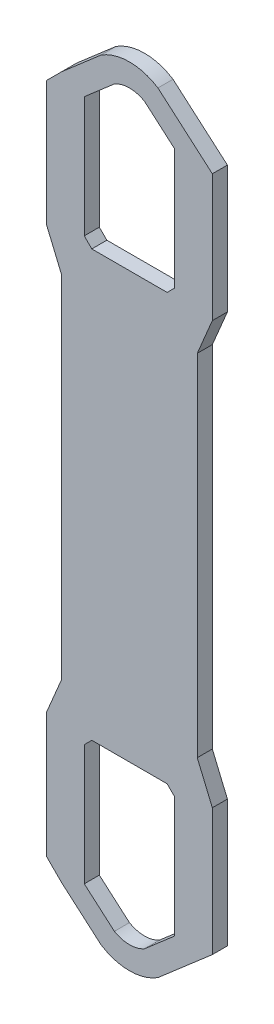
ISO-10303-21;
HEADER;
FILE_DESCRIPTION(('STEP AP214'),'2;1');
FILE_NAME('part.step','',(''),(''),'','','');
FILE_SCHEMA(('AUTOMOTIVE_DESIGN { 1 0 10303 214 1 1 1 1 }'));
ENDSEC;
DATA;
#1=APPLICATION_CONTEXT('core data for automotive mechanical design processes');
#2=APPLICATION_PROTOCOL_DEFINITION('international standard','automotive_design',2000,#1);
#3=PRODUCT_CONTEXT('',#1,'mechanical');
#4=PRODUCT('Part','Part','',(#3));
#5=PRODUCT_RELATED_PRODUCT_CATEGORY('part','',(#4));
#6=PRODUCT_DEFINITION_FORMATION('','',#4);
#7=PRODUCT_DEFINITION_CONTEXT('part definition',#1,'design');
#8=PRODUCT_DEFINITION('design','',#6,#7);
#9=PRODUCT_DEFINITION_SHAPE('','',#8);
#10=(LENGTH_UNIT() NAMED_UNIT(*) SI_UNIT(.MILLI.,.METRE.));
#11=(NAMED_UNIT(*) PLANE_ANGLE_UNIT() SI_UNIT($,.RADIAN.));
#12=(NAMED_UNIT(*) SI_UNIT($,.STERADIAN.) SOLID_ANGLE_UNIT());
#13=UNCERTAINTY_MEASURE_WITH_UNIT(LENGTH_MEASURE(1.E-05),#10,'distance_accuracy_value','');
#14=(GEOMETRIC_REPRESENTATION_CONTEXT(3) GLOBAL_UNCERTAINTY_ASSIGNED_CONTEXT((#13)) GLOBAL_UNIT_ASSIGNED_CONTEXT((#10,
#11,#12)) REPRESENTATION_CONTEXT('',''));
#15=CARTESIAN_POINT('',(0.,0.,0.));
#16=DIRECTION('',(0.,0.,1.));
#17=DIRECTION('',(1.,0.,0.));
#18=AXIS2_PLACEMENT_3D('',#15,#16,#17);
#19=CARTESIAN_POINT('',(0.,217.552949397752,5.));
#20=DIRECTION('',(0.,0.,-1.));
#21=DIRECTION('',(-1.,0.,0.));
#22=AXIS2_PLACEMENT_3D('',#19,#20,#21);
#23=CYLINDRICAL_SURFACE('',#22,9.99999999999999);
#24=CARTESIAN_POINT('',(0.,217.552949397752,0.));
#25=DIRECTION('',(0.,0.,1.));
#26=DIRECTION('',(1.,0.,0.));
#27=AXIS2_PLACEMENT_3D('',#24,#25,#26);
#28=CIRCLE('',#27,9.99999999999999);
#29=CARTESIAN_POINT('',(5.00000000000002,226.213203435596,0.));
#30=VERTEX_POINT('',#29);
#31=CARTESIAN_POINT('',(-5.,226.213203435596,0.));
#32=VERTEX_POINT('',#31);
#33=EDGE_CURVE('E364',#30,#32,#28,.T.);
#34=ORIENTED_EDGE('',*,*,#33,.F.);
#35=DIRECTION('',(0.,0.,-1.));
#36=VECTOR('',#35,1.);
#37=CARTESIAN_POINT('',(5.00000000000002,226.213203435596,5.));
#38=LINE('',#37,#36);
#39=CARTESIAN_POINT('',(5.00000000000002,226.213203435596,5.));
#40=VERTEX_POINT('',#39);
#41=EDGE_CURVE('E11',#40,#30,#38,.T.);
#42=ORIENTED_EDGE('',*,*,#41,.F.);
#43=CARTESIAN_POINT('',(0.,217.552949397752,5.));
#44=DIRECTION('',(0.,0.,1.));
#45=DIRECTION('',(1.,0.,0.));
#46=AXIS2_PLACEMENT_3D('',#43,#44,#45);
#47=CIRCLE('',#46,9.99999999999999);
#48=CARTESIAN_POINT('',(-5.,226.213203435596,5.));
#49=VERTEX_POINT('',#48);
#50=EDGE_CURVE('E537',#40,#49,#47,.T.);
#51=ORIENTED_EDGE('',*,*,#50,.T.);
#52=DIRECTION('',(0.,0.,-1.));
#53=VECTOR('',#52,1.);
#54=CARTESIAN_POINT('',(-5.,226.213203435596,5.));
#55=LINE('',#54,#53);
#56=EDGE_CURVE('E55',#49,#32,#55,.T.);
#57=ORIENTED_EDGE('',*,*,#56,.T.);
#58=EDGE_LOOP('',(#34,#42,#51,#57));
#59=FACE_BOUND('',#58,.T.);
#60=ADVANCED_FACE('F36',(#59),#23,.F.);
#61=CARTESIAN_POINT('',(114.089360483819,131.739045974011,5.));
#62=DIRECTION('',(-0.654653670707977,-0.755928946018455,0.));
#63=DIRECTION('',(0.755928946018455,-0.654653670707977,0.));
#64=AXIS2_PLACEMENT_3D('',#61,#62,#63);
#65=PLANE('',#64);
#66=DIRECTION('',(-0.755928946018455,0.654653670707977,0.));
#67=VECTOR('',#66,1.);
#68=CARTESIAN_POINT('',(114.089360483819,131.739045974011,0.));
#69=LINE('',#68,#67);
#70=CARTESIAN_POINT('',(15.,217.552949397752,0.));
#71=VERTEX_POINT('',#70);
#72=EDGE_CURVE('E366',#71,#30,#69,.T.);
#73=ORIENTED_EDGE('',*,*,#72,.F.);
#74=DIRECTION('',(0.,0.,-1.));
#75=VECTOR('',#74,1.);
#76=CARTESIAN_POINT('',(15.,217.552949397752,5.));
#77=LINE('',#76,#75);
#78=CARTESIAN_POINT('',(15.,217.552949397752,5.));
#79=VERTEX_POINT('',#78);
#80=EDGE_CURVE('E46',#79,#71,#77,.T.);
#81=ORIENTED_EDGE('',*,*,#80,.F.);
#82=DIRECTION('',(-0.755928946018455,0.654653670707977,0.));
#83=VECTOR('',#82,1.);
#84=CARTESIAN_POINT('',(114.089360483819,131.739045974011,5.));
#85=LINE('',#84,#83);
#86=EDGE_CURVE('E539',#79,#40,#85,.T.);
#87=ORIENTED_EDGE('',*,*,#86,.T.);
#88=ORIENTED_EDGE('',*,*,#41,.T.);
#89=EDGE_LOOP('',(#73,#81,#87,#88));
#90=FACE_BOUND('',#89,.T.);
#91=ADVANCED_FACE('F570',(#90),#65,.T.);
#92=CARTESIAN_POINT('',(15.,0.,5.));
#93=DIRECTION('',(1.,0.,0.));
#94=DIRECTION('',(0.,1.,0.));
#95=AXIS2_PLACEMENT_3D('',#92,#93,#94);
#96=PLANE('',#95);
#97=DIRECTION('',(0.,-1.,0.));
#98=VECTOR('',#97,1.);
#99=CARTESIAN_POINT('',(15.,0.,0.));
#100=LINE('',#99,#98);
#101=CARTESIAN_POINT('',(15.,177.552949397752,0.));
#102=VERTEX_POINT('',#101);
#103=EDGE_CURVE('E369',#71,#102,#100,.T.);
#104=ORIENTED_EDGE('',*,*,#103,.T.);
#105=DIRECTION('',(0.,0.,-1.));
#106=VECTOR('',#105,1.);
#107=CARTESIAN_POINT('',(15.,177.552949397752,5.));
#108=LINE('',#107,#106);
#109=CARTESIAN_POINT('',(15.,177.552949397752,5.));
#110=VERTEX_POINT('',#109);
#111=EDGE_CURVE('E392',#110,#102,#108,.T.);
#112=ORIENTED_EDGE('',*,*,#111,.F.);
#113=DIRECTION('',(0.,-1.,0.));
#114=VECTOR('',#113,1.);
#115=CARTESIAN_POINT('',(15.,0.,5.));
#116=LINE('',#115,#114);
#117=EDGE_CURVE('E542',#79,#110,#116,.T.);
#118=ORIENTED_EDGE('',*,*,#117,.F.);
#119=ORIENTED_EDGE('',*,*,#80,.T.);
#120=EDGE_LOOP('',(#104,#112,#118,#119));
#121=FACE_BOUND('',#120,.T.);
#122=ADVANCED_FACE('F575',(#121),#96,.F.);
#123=CARTESIAN_POINT('',(-81.2764746988762,81.2764746988778,5.));
#124=DIRECTION('',(0.70710678118654,-0.707106781186555,0.));
#125=DIRECTION('',(0.707106781186555,0.70710678118654,0.));
#126=AXIS2_PLACEMENT_3D('',#123,#124,#125);
#127=PLANE('',#126);
#128=DIRECTION('',(-0.707106781186555,-0.70710678118654,0.));
#129=VECTOR('',#128,1.);
#130=CARTESIAN_POINT('',(-81.2764746988762,81.2764746988778,0.));
#131=LINE('',#130,#129);
#132=CARTESIAN_POINT('',(12.5,175.052949397752,0.));
#133=VERTEX_POINT('',#132);
#134=EDGE_CURVE('E372',#102,#133,#131,.T.);
#135=ORIENTED_EDGE('',*,*,#134,.T.);
#136=DIRECTION('',(0.,0.,-1.));
#137=VECTOR('',#136,1.);
#138=CARTESIAN_POINT('',(12.5,175.052949397752,5.));
#139=LINE('',#138,#137);
#140=CARTESIAN_POINT('',(12.5,175.052949397752,5.));
#141=VERTEX_POINT('',#140);
#142=EDGE_CURVE('E389',#141,#133,#139,.T.);
#143=ORIENTED_EDGE('',*,*,#142,.F.);
#144=DIRECTION('',(-0.707106781186555,-0.70710678118654,0.));
#145=VECTOR('',#144,1.);
#146=CARTESIAN_POINT('',(-81.2764746988762,81.2764746988778,5.));
#147=LINE('',#146,#145);
#148=EDGE_CURVE('E545',#110,#141,#147,.T.);
#149=ORIENTED_EDGE('',*,*,#148,.F.);
#150=ORIENTED_EDGE('',*,*,#111,.T.);
#151=EDGE_LOOP('',(#135,#143,#149,#150));
#152=FACE_BOUND('',#151,.T.);
#153=ADVANCED_FACE('F551',(#152),#127,.F.);
#154=CARTESIAN_POINT('',(0.,175.052949397752,5.));
#155=DIRECTION('',(0.,-1.,0.));
#156=DIRECTION('',(0.,0.,-1.));
#157=AXIS2_PLACEMENT_3D('',#154,#155,#156);
#158=PLANE('',#157);
#159=DIRECTION('',(-1.,0.,0.));
#160=VECTOR('',#159,1.);
#161=CARTESIAN_POINT('',(0.,175.052949397752,0.));
#162=LINE('',#161,#160);
#163=CARTESIAN_POINT('',(-12.5,175.052949397752,0.));
#164=VERTEX_POINT('',#163);
#165=EDGE_CURVE('E375',#133,#164,#162,.T.);
#166=ORIENTED_EDGE('',*,*,#165,.T.);
#167=DIRECTION('',(0.,0.,-1.));
#168=VECTOR('',#167,1.);
#169=CARTESIAN_POINT('',(-12.5,175.052949397752,5.));
#170=LINE('',#169,#168);
#171=CARTESIAN_POINT('',(-12.5,175.052949397752,5.));
#172=VERTEX_POINT('',#171);
#173=EDGE_CURVE('E274',#172,#164,#170,.T.);
#174=ORIENTED_EDGE('',*,*,#173,.F.);
#175=DIRECTION('',(-1.,0.,0.));
#176=VECTOR('',#175,1.);
#177=CARTESIAN_POINT('',(0.,175.052949397752,5.));
#178=LINE('',#177,#176);
#179=EDGE_CURVE('E283',#141,#172,#178,.T.);
#180=ORIENTED_EDGE('',*,*,#179,.F.);
#181=ORIENTED_EDGE('',*,*,#142,.T.);
#182=EDGE_LOOP('',(#166,#174,#180,#181));
#183=FACE_BOUND('',#182,.T.);
#184=ADVANCED_FACE('F553',(#183),#158,.F.);
#185=CARTESIAN_POINT('',(81.2764746988762,81.2764746988779,5.));
#186=DIRECTION('',(0.70710678118654,0.707106781186555,0.));
#187=DIRECTION('',(-0.707106781186555,0.70710678118654,0.));
#188=AXIS2_PLACEMENT_3D('',#185,#186,#187);
#189=PLANE('',#188);
#190=DIRECTION('',(0.707106781186555,-0.70710678118654,0.));
#191=VECTOR('',#190,1.);
#192=CARTESIAN_POINT('',(81.2764746988762,81.2764746988779,0.));
#193=LINE('',#192,#191);
#194=CARTESIAN_POINT('',(-15.,177.552949397752,0.));
#195=VERTEX_POINT('',#194);
#196=EDGE_CURVE('E270',#195,#164,#193,.T.);
#197=ORIENTED_EDGE('',*,*,#196,.F.);
#198=DIRECTION('',(0.,0.,-1.));
#199=VECTOR('',#198,1.);
#200=CARTESIAN_POINT('',(-15.,177.552949397752,5.));
#201=LINE('',#200,#199);
#202=CARTESIAN_POINT('',(-15.,177.552949397752,5.));
#203=VERTEX_POINT('',#202);
#204=EDGE_CURVE('E265',#203,#195,#201,.T.);
#205=ORIENTED_EDGE('',*,*,#204,.F.);
#206=DIRECTION('',(0.707106781186555,-0.70710678118654,0.));
#207=VECTOR('',#206,1.);
#208=CARTESIAN_POINT('',(81.2764746988762,81.2764746988779,5.));
#209=LINE('',#208,#207);
#210=EDGE_CURVE('E268',#203,#172,#209,.T.);
#211=ORIENTED_EDGE('',*,*,#210,.T.);
#212=ORIENTED_EDGE('',*,*,#173,.T.);
#213=EDGE_LOOP('',(#197,#205,#211,#212));
#214=FACE_BOUND('',#213,.T.);
#215=ADVANCED_FACE('F267',(#214),#189,.T.);
#216=CARTESIAN_POINT('',(-15.,0.,5.));
#217=DIRECTION('',(1.,0.,0.));
#218=DIRECTION('',(0.,1.,0.));
#219=AXIS2_PLACEMENT_3D('',#216,#217,#218);
#220=PLANE('',#219);
#221=DIRECTION('',(0.,-1.,0.));
#222=VECTOR('',#221,1.);
#223=CARTESIAN_POINT('',(-15.,0.,0.));
#224=LINE('',#223,#222);
#225=CARTESIAN_POINT('',(-15.,217.552949397752,0.));
#226=VERTEX_POINT('',#225);
#227=EDGE_CURVE('E379',#226,#195,#224,.T.);
#228=ORIENTED_EDGE('',*,*,#227,.F.);
#229=DIRECTION('',(0.,0.,-1.));
#230=VECTOR('',#229,1.);
#231=CARTESIAN_POINT('',(-15.,217.552949397752,5.));
#232=LINE('',#231,#230);
#233=CARTESIAN_POINT('',(-15.,217.552949397752,5.));
#234=VERTEX_POINT('',#233);
#235=EDGE_CURVE('E158',#234,#226,#232,.T.);
#236=ORIENTED_EDGE('',*,*,#235,.F.);
#237=DIRECTION('',(0.,-1.,0.));
#238=VECTOR('',#237,1.);
#239=CARTESIAN_POINT('',(-15.,0.,5.));
#240=LINE('',#239,#238);
#241=EDGE_CURVE('E281',#234,#203,#240,.T.);
#242=ORIENTED_EDGE('',*,*,#241,.T.);
#243=ORIENTED_EDGE('',*,*,#204,.T.);
#244=EDGE_LOOP('',(#228,#236,#242,#243));
#245=FACE_BOUND('',#244,.T.);
#246=ADVANCED_FACE('F286',(#245),#220,.T.);
#247=CARTESIAN_POINT('',(10.7142857142857,-12.3717914826348,5.));
#248=DIRECTION('',(0.654653670707977,-0.755928946018455,0.));
#249=DIRECTION('',(0.755928946018455,0.654653670707977,0.));
#250=AXIS2_PLACEMENT_3D('',#247,#248,#249);
#251=PLANE('',#250);
#252=DIRECTION('',(-0.755928946018455,-0.654653670707977,0.));
#253=VECTOR('',#252,1.);
#254=CARTESIAN_POINT('',(10.7142857142857,-12.3717914826348,0.));
#255=LINE('',#254,#253);
#256=CARTESIAN_POINT('',(15.,-8.66025403784438,0.));
#257=VERTEX_POINT('',#256);
#258=CARTESIAN_POINT('',(5.,-17.3205080756888,0.));
#259=VERTEX_POINT('',#258);
#260=EDGE_CURVE('E343',#257,#259,#255,.T.);
#261=ORIENTED_EDGE('',*,*,#260,.T.);
#262=DIRECTION('',(0.,0.,-1.));
#263=VECTOR('',#262,1.);
#264=CARTESIAN_POINT('',(5.,-17.3205080756888,5.));
#265=LINE('',#264,#263);
#266=CARTESIAN_POINT('',(5.,-17.3205080756888,5.));
#267=VERTEX_POINT('',#266);
#268=EDGE_CURVE('E386',#267,#259,#265,.T.);
#269=ORIENTED_EDGE('',*,*,#268,.F.);
#270=DIRECTION('',(-0.755928946018455,-0.654653670707977,0.));
#271=VECTOR('',#270,1.);
#272=CARTESIAN_POINT('',(10.7142857142857,-12.3717914826348,5.));
#273=LINE('',#272,#271);
#274=CARTESIAN_POINT('',(15.,-8.66025403784438,5.));
#275=VERTEX_POINT('',#274);
#276=EDGE_CURVE('E517',#275,#267,#273,.T.);
#277=ORIENTED_EDGE('',*,*,#276,.F.);
#278=DIRECTION('',(0.,0.,-1.));
#279=VECTOR('',#278,1.);
#280=CARTESIAN_POINT('',(15.,-8.66025403784438,5.));
#281=LINE('',#280,#279);
#282=EDGE_CURVE('E396',#275,#257,#281,.T.);
#283=ORIENTED_EDGE('',*,*,#282,.T.);
#284=EDGE_LOOP('',(#261,#269,#277,#283));
#285=FACE_BOUND('',#284,.T.);
#286=ADVANCED_FACE('F607',(#285),#251,.F.);
#287=CARTESIAN_POINT('',(0.,-8.66025403784438,5.));
#288=DIRECTION('',(0.,0.,-1.));
#289=DIRECTION('',(-1.,0.,0.));
#290=AXIS2_PLACEMENT_3D('',#287,#288,#289);
#291=CYLINDRICAL_SURFACE('',#290,10.);
#292=CARTESIAN_POINT('',(0.,-8.66025403784438,0.));
#293=DIRECTION('',(0.,0.,1.));
#294=DIRECTION('',(1.,0.,0.));
#295=AXIS2_PLACEMENT_3D('',#292,#293,#294);
#296=CIRCLE('',#295,10.);
#297=CARTESIAN_POINT('',(-5.,-17.3205080756888,0.));
#298=VERTEX_POINT('',#297);
#299=EDGE_CURVE('E346',#259,#298,#296,.F.);
#300=ORIENTED_EDGE('',*,*,#299,.T.);
#301=DIRECTION('',(0.,0.,-1.));
#302=VECTOR('',#301,1.);
#303=CARTESIAN_POINT('',(-5.,-17.3205080756888,5.));
#304=LINE('',#303,#302);
#305=CARTESIAN_POINT('',(-5.,-17.3205080756888,5.));
#306=VERTEX_POINT('',#305);
#307=EDGE_CURVE('E410',#306,#298,#304,.T.);
#308=ORIENTED_EDGE('',*,*,#307,.F.);
#309=CARTESIAN_POINT('',(0.,-8.66025403784438,5.));
#310=DIRECTION('',(0.,0.,1.));
#311=DIRECTION('',(1.,0.,0.));
#312=AXIS2_PLACEMENT_3D('',#309,#310,#311);
#313=CIRCLE('',#312,10.);
#314=EDGE_CURVE('E520',#267,#306,#313,.F.);
#315=ORIENTED_EDGE('',*,*,#314,.F.);
#316=ORIENTED_EDGE('',*,*,#268,.T.);
#317=EDGE_LOOP('',(#300,#308,#315,#316));
#318=FACE_BOUND('',#317,.T.);
#319=ADVANCED_FACE('F603',(#318),#291,.F.);
#320=CARTESIAN_POINT('',(-10.7142857142857,-12.3717914826348,5.));
#321=DIRECTION('',(-0.654653670707977,-0.755928946018455,0.));
#322=DIRECTION('',(0.755928946018455,-0.654653670707977,0.));
#323=AXIS2_PLACEMENT_3D('',#320,#321,#322);
#324=PLANE('',#323);
#325=DIRECTION('',(-0.755928946018455,0.654653670707977,0.));
#326=VECTOR('',#325,1.);
#327=CARTESIAN_POINT('',(-10.7142857142857,-12.3717914826348,0.));
#328=LINE('',#327,#326);
#329=CARTESIAN_POINT('',(-15.,-8.66025403784438,0.));
#330=VERTEX_POINT('',#329);
#331=EDGE_CURVE('E348',#298,#330,#328,.T.);
#332=ORIENTED_EDGE('',*,*,#331,.T.);
#333=DIRECTION('',(0.,0.,-1.));
#334=VECTOR('',#333,1.);
#335=CARTESIAN_POINT('',(-15.,-8.66025403784438,5.));
#336=LINE('',#335,#334);
#337=CARTESIAN_POINT('',(-15.,-8.66025403784438,5.));
#338=VERTEX_POINT('',#337);
#339=EDGE_CURVE('E407',#338,#330,#336,.T.);
#340=ORIENTED_EDGE('',*,*,#339,.F.);
#341=DIRECTION('',(-0.755928946018455,0.654653670707977,0.));
#342=VECTOR('',#341,1.);
#343=CARTESIAN_POINT('',(-10.7142857142857,-12.3717914826348,5.));
#344=LINE('',#343,#342);
#345=EDGE_CURVE('E522',#306,#338,#344,.T.);
#346=ORIENTED_EDGE('',*,*,#345,.F.);
#347=ORIENTED_EDGE('',*,*,#307,.T.);
#348=EDGE_LOOP('',(#332,#340,#346,#347));
#349=FACE_BOUND('',#348,.T.);
#350=ADVANCED_FACE('F599',(#349),#324,.F.);
#351=CARTESIAN_POINT('',(-15.,0.,5.));
#352=DIRECTION('',(-1.,0.,0.));
#353=DIRECTION('',(0.,0.,1.));
#354=AXIS2_PLACEMENT_3D('',#351,#352,#353);
#355=PLANE('',#354);
#356=DIRECTION('',(0.,1.,0.));
#357=VECTOR('',#356,1.);
#358=CARTESIAN_POINT('',(-15.,0.,0.));
#359=LINE('',#358,#357);
#360=CARTESIAN_POINT('',(-15.,31.3397459621556,0.));
#361=VERTEX_POINT('',#360);
#362=EDGE_CURVE('E350',#330,#361,#359,.T.);
#363=ORIENTED_EDGE('',*,*,#362,.T.);
#364=DIRECTION('',(0.,0.,-1.));
#365=VECTOR('',#364,1.);
#366=CARTESIAN_POINT('',(-15.,31.3397459621556,5.));
#367=LINE('',#366,#365);
#368=CARTESIAN_POINT('',(-15.,31.3397459621556,5.));
#369=VERTEX_POINT('',#368);
#370=EDGE_CURVE('E404',#369,#361,#367,.T.);
#371=ORIENTED_EDGE('',*,*,#370,.F.);
#372=DIRECTION('',(0.,1.,0.));
#373=VECTOR('',#372,1.);
#374=CARTESIAN_POINT('',(-15.,0.,5.));
#375=LINE('',#374,#373);
#376=EDGE_CURVE('E524',#338,#369,#375,.T.);
#377=ORIENTED_EDGE('',*,*,#376,.F.);
#378=ORIENTED_EDGE('',*,*,#339,.T.);
#379=EDGE_LOOP('',(#363,#371,#377,#378));
#380=FACE_BOUND('',#379,.T.);
#381=ADVANCED_FACE('F595',(#380),#355,.F.);
#382=CARTESIAN_POINT('',(-23.1698729810779,23.1698729810777,5.));
#383=DIRECTION('',(-0.70710678118655,0.707106781186545,0.));
#384=DIRECTION('',(-0.707106781186545,-0.70710678118655,0.));
#385=AXIS2_PLACEMENT_3D('',#382,#383,#384);
#386=PLANE('',#385);
#387=DIRECTION('',(0.707106781186545,0.70710678118655,0.));
#388=VECTOR('',#387,1.);
#389=CARTESIAN_POINT('',(-23.1698729810779,23.1698729810777,0.));
#390=LINE('',#389,#388);
#391=CARTESIAN_POINT('',(-12.5,33.8397459621556,0.));
#392=VERTEX_POINT('',#391);
#393=EDGE_CURVE('E352',#361,#392,#390,.T.);
#394=ORIENTED_EDGE('',*,*,#393,.T.);
#395=DIRECTION('',(0.,0.,-1.));
#396=VECTOR('',#395,1.);
#397=CARTESIAN_POINT('',(-12.5,33.8397459621556,5.));
#398=LINE('',#397,#396);
#399=CARTESIAN_POINT('',(-12.5,33.8397459621556,5.));
#400=VERTEX_POINT('',#399);
#401=EDGE_CURVE('E402',#400,#392,#398,.T.);
#402=ORIENTED_EDGE('',*,*,#401,.F.);
#403=DIRECTION('',(0.707106781186545,0.70710678118655,0.));
#404=VECTOR('',#403,1.);
#405=CARTESIAN_POINT('',(-23.1698729810779,23.1698729810777,5.));
#406=LINE('',#405,#404);
#407=EDGE_CURVE('E526',#369,#400,#406,.T.);
#408=ORIENTED_EDGE('',*,*,#407,.F.);
#409=ORIENTED_EDGE('',*,*,#370,.T.);
#410=EDGE_LOOP('',(#394,#402,#408,#409));
#411=FACE_BOUND('',#410,.T.);
#412=ADVANCED_FACE('F591',(#411),#386,.F.);
#413=CARTESIAN_POINT('',(0.,33.8397459621556,5.));
#414=DIRECTION('',(0.,-1.,0.));
#415=DIRECTION('',(0.,0.,-1.));
#416=AXIS2_PLACEMENT_3D('',#413,#414,#415);
#417=PLANE('',#416);
#418=DIRECTION('',(-1.,0.,0.));
#419=VECTOR('',#418,1.);
#420=CARTESIAN_POINT('',(0.,33.8397459621556,0.));
#421=LINE('',#420,#419);
#422=CARTESIAN_POINT('',(12.5,33.8397459621556,0.));
#423=VERTEX_POINT('',#422);
#424=EDGE_CURVE('E355',#423,#392,#421,.T.);
#425=ORIENTED_EDGE('',*,*,#424,.F.);
#426=DIRECTION('',(0.,0.,-1.));
#427=VECTOR('',#426,1.);
#428=CARTESIAN_POINT('',(12.5,33.8397459621556,5.));
#429=LINE('',#428,#427);
#430=CARTESIAN_POINT('',(12.5,33.8397459621556,5.));
#431=VERTEX_POINT('',#430);
#432=EDGE_CURVE('E400',#431,#423,#429,.T.);
#433=ORIENTED_EDGE('',*,*,#432,.F.);
#434=DIRECTION('',(-1.,0.,0.));
#435=VECTOR('',#434,1.);
#436=CARTESIAN_POINT('',(0.,33.8397459621556,5.));
#437=LINE('',#436,#435);
#438=EDGE_CURVE('E528',#431,#400,#437,.T.);
#439=ORIENTED_EDGE('',*,*,#438,.T.);
#440=ORIENTED_EDGE('',*,*,#401,.T.);
#441=EDGE_LOOP('',(#425,#433,#439,#440));
#442=FACE_BOUND('',#441,.T.);
#443=ADVANCED_FACE('F587',(#442),#417,.T.);
#444=CARTESIAN_POINT('',(23.1698729810777,23.169872981078,5.));
#445=DIRECTION('',(-0.707106781186543,-0.707106781186552,0.));
#446=DIRECTION('',(0.707106781186552,-0.707106781186543,0.));
#447=AXIS2_PLACEMENT_3D('',#444,#445,#446);
#448=PLANE('',#447);
#449=DIRECTION('',(-0.707106781186552,0.707106781186543,0.));
#450=VECTOR('',#449,1.);
#451=CARTESIAN_POINT('',(23.1698729810777,23.169872981078,0.));
#452=LINE('',#451,#450);
#453=CARTESIAN_POINT('',(15.,31.3397459621556,0.));
#454=VERTEX_POINT('',#453);
#455=EDGE_CURVE('E358',#454,#423,#452,.T.);
#456=ORIENTED_EDGE('',*,*,#455,.F.);
#457=DIRECTION('',(0.,0.,-1.));
#458=VECTOR('',#457,1.);
#459=CARTESIAN_POINT('',(15.,31.3397459621556,5.));
#460=LINE('',#459,#458);
#461=CARTESIAN_POINT('',(15.,31.3397459621556,5.));
#462=VERTEX_POINT('',#461);
#463=EDGE_CURVE('E398',#462,#454,#460,.T.);
#464=ORIENTED_EDGE('',*,*,#463,.F.);
#465=DIRECTION('',(-0.707106781186552,0.707106781186543,0.));
#466=VECTOR('',#465,1.);
#467=CARTESIAN_POINT('',(23.1698729810777,23.169872981078,5.));
#468=LINE('',#467,#466);
#469=EDGE_CURVE('E531',#462,#431,#468,.T.);
#470=ORIENTED_EDGE('',*,*,#469,.T.);
#471=ORIENTED_EDGE('',*,*,#432,.T.);
#472=EDGE_LOOP('',(#456,#464,#470,#471));
#473=FACE_BOUND('',#472,.T.);
#474=ADVANCED_FACE('F584',(#473),#448,.T.);
#475=CARTESIAN_POINT('',(-118.999263014129,137.408513069149,5.));
#476=DIRECTION('',(0.654653670707977,-0.755928946018455,0.));
#477=DIRECTION('',(0.755928946018455,0.654653670707977,0.));
#478=AXIS2_PLACEMENT_3D('',#475,#476,#477);
#479=PLANE('',#478);
#480=DIRECTION('',(-0.755928946018455,-0.654653670707977,0.));
#481=VECTOR('',#480,1.);
#482=CARTESIAN_POINT('',(-118.999263014129,137.408513069149,0.));
#483=LINE('',#482,#481);
#484=CARTESIAN_POINT('',(-9.44497339686341,232.285310971259,0.));
#485=VERTEX_POINT('',#484);
#486=CARTESIAN_POINT('',(-22.5,220.979326285861,0.));
#487=VERTEX_POINT('',#486);
#488=EDGE_CURVE('E293',#485,#487,#483,.T.);
#489=ORIENTED_EDGE('',*,*,#488,.T.);
#490=DIRECTION('',(0.,0.,-1.));
#491=VECTOR('',#490,1.);
#492=CARTESIAN_POINT('',(-22.5,220.979326285861,5.));
#493=LINE('',#492,#491);
#494=CARTESIAN_POINT('',(-22.5,220.979326285861,5.));
#495=VERTEX_POINT('',#494);
#496=EDGE_CURVE('E40',#495,#487,#493,.T.);
#497=ORIENTED_EDGE('',*,*,#496,.F.);
#498=DIRECTION('',(-0.755928946018455,-0.654653670707977,0.));
#499=VECTOR('',#498,1.);
#500=CARTESIAN_POINT('',(-118.999263014129,137.408513069149,5.));
#501=LINE('',#500,#499);
#502=CARTESIAN_POINT('',(-9.44497339686341,232.285310971259,5.));
#503=VERTEX_POINT('',#502);
#504=EDGE_CURVE('E384',#503,#495,#501,.T.);
#505=ORIENTED_EDGE('',*,*,#504,.F.);
#506=DIRECTION('',(0.,0.,-1.));
#507=VECTOR('',#506,1.);
#508=CARTESIAN_POINT('',(-9.44497339686341,232.285310971259,5.));
#509=LINE('',#508,#507);
#510=EDGE_CURVE('E289',#503,#485,#509,.T.);
#511=ORIENTED_EDGE('',*,*,#510,.T.);
#512=EDGE_LOOP('',(#489,#497,#505,#511));
#513=FACE_BOUND('',#512,.T.);
#514=ADVANCED_FACE('F38',(#513),#479,.F.);
#515=CARTESIAN_POINT('',(-121.739663142931,121.73966314293,5.));
#516=DIRECTION('',(0.707106781186548,-0.707106781186547,0.));
#517=DIRECTION('',(0.707106781186547,0.707106781186548,0.));
#518=AXIS2_PLACEMENT_3D('',#515,#516,#517);
#519=PLANE('',#518);
#520=DIRECTION('',(-0.707106781186547,-0.707106781186548,0.));
#521=VECTOR('',#520,1.);
#522=CARTESIAN_POINT('',(-121.739663142931,121.73966314293,0.));
#523=LINE('',#522,#521);
#524=CARTESIAN_POINT('',(-27.5,215.979326285861,0.));
#525=VERTEX_POINT('',#524);
#526=EDGE_CURVE('E296',#487,#525,#523,.T.);
#527=ORIENTED_EDGE('',*,*,#526,.T.);
#528=DIRECTION('',(0.,0.,-1.));
#529=VECTOR('',#528,1.);
#530=CARTESIAN_POINT('',(-27.5,215.979326285861,5.));
#531=LINE('',#530,#529);
#532=CARTESIAN_POINT('',(-27.5,215.979326285861,5.));
#533=VERTEX_POINT('',#532);
#534=EDGE_CURVE('E448',#533,#525,#531,.T.);
#535=ORIENTED_EDGE('',*,*,#534,.F.);
#536=DIRECTION('',(-0.707106781186547,-0.707106781186548,0.));
#537=VECTOR('',#536,1.);
#538=CARTESIAN_POINT('',(-121.739663142931,121.73966314293,5.));
#539=LINE('',#538,#537);
#540=EDGE_CURVE('E171',#495,#533,#539,.T.);
#541=ORIENTED_EDGE('',*,*,#540,.F.);
#542=ORIENTED_EDGE('',*,*,#496,.T.);
#543=EDGE_LOOP('',(#527,#535,#541,#542));
#544=FACE_BOUND('',#543,.T.);
#545=ADVANCED_FACE('F454',(#544),#519,.F.);
#546=CARTESIAN_POINT('',(-27.5,0.,5.));
#547=DIRECTION('',(1.,0.,0.));
#548=DIRECTION('',(0.,0.,-1.));
#549=AXIS2_PLACEMENT_3D('',#546,#547,#548);
#550=PLANE('',#549);
#551=DIRECTION('',(0.,-1.,0.));
#552=VECTOR('',#551,1.);
#553=CARTESIAN_POINT('',(-27.5,0.,0.));
#554=LINE('',#553,#552);
#555=CARTESIAN_POINT('',(-27.5,174.446347679954,0.));
#556=VERTEX_POINT('',#555);
#557=EDGE_CURVE('E298',#525,#556,#554,.T.);
#558=ORIENTED_EDGE('',*,*,#557,.T.);
#559=DIRECTION('',(0.,0.,-1.));
#560=VECTOR('',#559,1.);
#561=CARTESIAN_POINT('',(-27.5,174.446347679954,5.));
#562=LINE('',#561,#560);
#563=CARTESIAN_POINT('',(-27.5,174.446347679954,5.));
#564=VERTEX_POINT('',#563);
#565=EDGE_CURVE('E446',#564,#556,#562,.T.);
#566=ORIENTED_EDGE('',*,*,#565,.F.);
#567=DIRECTION('',(0.,-1.,0.));
#568=VECTOR('',#567,1.);
#569=CARTESIAN_POINT('',(-27.5,0.,5.));
#570=LINE('',#569,#568);
#571=EDGE_CURVE('E476',#533,#564,#570,.T.);
#572=ORIENTED_EDGE('',*,*,#571,.F.);
#573=ORIENTED_EDGE('',*,*,#534,.T.);
#574=EDGE_LOOP('',(#558,#566,#572,#573));
#575=FACE_BOUND('',#574,.T.);
#576=ADVANCED_FACE('F466',(#575),#550,.F.);
#577=CARTESIAN_POINT('',(38.9530203483583,16.375900068297,5.));
#578=DIRECTION('',(0.921849978795553,0.387546921797399,0.));
#579=DIRECTION('',(-0.387546921797399,0.921849978795553,0.));
#580=AXIS2_PLACEMENT_3D('',#577,#578,#579);
#581=PLANE('',#580);
#582=DIRECTION('',(0.387546921797399,-0.921849978795553,0.));
#583=VECTOR('',#582,1.);
#584=CARTESIAN_POINT('',(38.9530203483583,16.375900068297,0.));
#585=LINE('',#584,#583);
#586=CARTESIAN_POINT('',(-22.5,162.552949397752,0.));
#587=VERTEX_POINT('',#586);
#588=EDGE_CURVE('E300',#556,#587,#585,.T.);
#589=ORIENTED_EDGE('',*,*,#588,.T.);
#590=DIRECTION('',(0.,0.,-1.));
#591=VECTOR('',#590,1.);
#592=CARTESIAN_POINT('',(-22.5,162.552949397752,5.));
#593=LINE('',#592,#591);
#594=CARTESIAN_POINT('',(-22.5,162.552949397752,5.));
#595=VERTEX_POINT('',#594);
#596=EDGE_CURVE('E444',#595,#587,#593,.T.);
#597=ORIENTED_EDGE('',*,*,#596,.F.);
#598=DIRECTION('',(0.387546921797399,-0.921849978795553,0.));
#599=VECTOR('',#598,1.);
#600=CARTESIAN_POINT('',(38.9530203483583,16.375900068297,5.));
#601=LINE('',#600,#599);
#602=EDGE_CURVE('E471',#564,#595,#601,.T.);
#603=ORIENTED_EDGE('',*,*,#602,.F.);
#604=ORIENTED_EDGE('',*,*,#565,.T.);
#605=EDGE_LOOP('',(#589,#597,#603,#604));
#606=FACE_BOUND('',#605,.T.);
#607=ADVANCED_FACE('F469',(#606),#581,.F.);
#608=CARTESIAN_POINT('',(-22.5,0.,5.));
#609=DIRECTION('',(-1.,0.,0.));
#610=DIRECTION('',(0.,-1.,0.));
#611=AXIS2_PLACEMENT_3D('',#608,#609,#610);
#612=PLANE('',#611);
#613=DIRECTION('',(0.,1.,0.));
#614=VECTOR('',#613,1.);
#615=CARTESIAN_POINT('',(-22.5,0.,0.));
#616=LINE('',#615,#614);
#617=CARTESIAN_POINT('',(-22.5,46.3397459621556,0.));
#618=VERTEX_POINT('',#617);
#619=EDGE_CURVE('E303',#618,#587,#616,.T.);
#620=ORIENTED_EDGE('',*,*,#619,.F.);
#621=DIRECTION('',(0.,0.,-1.));
#622=VECTOR('',#621,1.);
#623=CARTESIAN_POINT('',(-22.5,46.3397459621556,5.));
#624=LINE('',#623,#622);
#625=CARTESIAN_POINT('',(-22.5,46.3397459621556,5.));
#626=VERTEX_POINT('',#625);
#627=EDGE_CURVE('E442',#626,#618,#624,.T.);
#628=ORIENTED_EDGE('',*,*,#627,.F.);
#629=DIRECTION('',(0.,1.,0.));
#630=VECTOR('',#629,1.);
#631=CARTESIAN_POINT('',(-22.5,0.,5.));
#632=LINE('',#631,#630);
#633=EDGE_CURVE('E475',#626,#595,#632,.T.);
#634=ORIENTED_EDGE('',*,*,#633,.T.);
#635=ORIENTED_EDGE('',*,*,#596,.T.);
#636=EDGE_LOOP('',(#620,#628,#634,#635));
#637=FACE_BOUND('',#636,.T.);
#638=ADVANCED_FACE('F658',(#637),#612,.T.);
#639=CARTESIAN_POINT('',(-35.6760094058833,14.9982404353143,5.));
#640=DIRECTION('',(-0.921849978795553,0.387546921797398,0.));
#641=DIRECTION('',(-0.387546921797398,-0.921849978795553,0.));
#642=AXIS2_PLACEMENT_3D('',#639,#640,#641);
#643=PLANE('',#642);
#644=DIRECTION('',(0.387546921797398,0.921849978795553,0.));
#645=VECTOR('',#644,1.);
#646=CARTESIAN_POINT('',(-35.6760094058833,14.9982404353143,0.));
#647=LINE('',#646,#645);
#648=CARTESIAN_POINT('',(-27.5,34.4463476799538,0.));
#649=VERTEX_POINT('',#648);
#650=EDGE_CURVE('E306',#649,#618,#647,.T.);
#651=ORIENTED_EDGE('',*,*,#650,.F.);
#652=DIRECTION('',(0.,0.,-1.));
#653=VECTOR('',#652,1.);
#654=CARTESIAN_POINT('',(-27.5,34.4463476799538,5.));
#655=LINE('',#654,#653);
#656=CARTESIAN_POINT('',(-27.5,34.4463476799538,5.));
#657=VERTEX_POINT('',#656);
#658=EDGE_CURVE('E440',#657,#649,#655,.T.);
#659=ORIENTED_EDGE('',*,*,#658,.F.);
#660=DIRECTION('',(0.387546921797398,0.921849978795553,0.));
#661=VECTOR('',#660,1.);
#662=CARTESIAN_POINT('',(-35.6760094058833,14.9982404353143,5.));
#663=LINE('',#662,#661);
#664=EDGE_CURVE('E478',#657,#626,#663,.T.);
#665=ORIENTED_EDGE('',*,*,#664,.T.);
#666=ORIENTED_EDGE('',*,*,#627,.T.);
#667=EDGE_LOOP('',(#651,#659,#665,#666));
#668=FACE_BOUND('',#667,.T.);
#669=ADVANCED_FACE('F654',(#668),#643,.T.);
#670=CARTESIAN_POINT('',(-27.5,0.,5.));
#671=DIRECTION('',(-1.,0.,0.));
#672=DIRECTION('',(0.,0.,1.));
#673=AXIS2_PLACEMENT_3D('',#670,#671,#672);
#674=PLANE('',#673);
#675=DIRECTION('',(0.,1.,0.));
#676=VECTOR('',#675,1.);
#677=CARTESIAN_POINT('',(-27.5,0.,0.));
#678=LINE('',#677,#676);
#679=CARTESIAN_POINT('',(-27.5,-7.08663092595332,0.));
#680=VERTEX_POINT('',#679);
#681=EDGE_CURVE('E309',#680,#649,#678,.T.);
#682=ORIENTED_EDGE('',*,*,#681,.F.);
#683=DIRECTION('',(0.,0.,-1.));
#684=VECTOR('',#683,1.);
#685=CARTESIAN_POINT('',(-27.5,-7.08663092595332,5.));
#686=LINE('',#685,#684);
#687=CARTESIAN_POINT('',(-27.5,-7.08663092595332,5.));
#688=VERTEX_POINT('',#687);
#689=EDGE_CURVE('E438',#688,#680,#686,.T.);
#690=ORIENTED_EDGE('',*,*,#689,.F.);
#691=DIRECTION('',(0.,1.,0.));
#692=VECTOR('',#691,1.);
#693=CARTESIAN_POINT('',(-27.5,0.,5.));
#694=LINE('',#693,#692);
#695=EDGE_CURVE('E485',#688,#657,#694,.T.);
#696=ORIENTED_EDGE('',*,*,#695,.T.);
#697=ORIENTED_EDGE('',*,*,#658,.T.);
#698=EDGE_LOOP('',(#682,#690,#696,#697));
#699=FACE_BOUND('',#698,.T.);
#700=ADVANCED_FACE('F650',(#699),#674,.T.);
#701=CARTESIAN_POINT('',(-17.2933154629766,-17.2933154629767,5.));
#702=DIRECTION('',(-0.707106781186546,-0.707106781186549,0.));
#703=DIRECTION('',(0.707106781186549,-0.707106781186546,0.));
#704=AXIS2_PLACEMENT_3D('',#701,#702,#703);
#705=PLANE('',#704);
#706=DIRECTION('',(-0.707106781186549,0.707106781186546,0.));
#707=VECTOR('',#706,1.);
#708=CARTESIAN_POINT('',(-17.2933154629766,-17.2933154629767,0.));
#709=LINE('',#708,#707);
#710=CARTESIAN_POINT('',(-22.5,-12.0866309259533,0.));
#711=VERTEX_POINT('',#710);
#712=EDGE_CURVE('E312',#711,#680,#709,.T.);
#713=ORIENTED_EDGE('',*,*,#712,.F.);
#714=DIRECTION('',(0.,0.,-1.));
#715=VECTOR('',#714,1.);
#716=CARTESIAN_POINT('',(-22.5,-12.0866309259533,5.));
#717=LINE('',#716,#715);
#718=CARTESIAN_POINT('',(-22.5,-12.0866309259533,5.));
#719=VERTEX_POINT('',#718);
#720=EDGE_CURVE('E436',#719,#711,#717,.T.);
#721=ORIENTED_EDGE('',*,*,#720,.F.);
#722=DIRECTION('',(-0.707106781186549,0.707106781186546,0.));
#723=VECTOR('',#722,1.);
#724=CARTESIAN_POINT('',(-17.2933154629766,-17.2933154629767,5.));
#725=LINE('',#724,#723);
#726=EDGE_CURVE('E488',#719,#688,#725,.T.);
#727=ORIENTED_EDGE('',*,*,#726,.T.);
#728=ORIENTED_EDGE('',*,*,#689,.T.);
#729=EDGE_LOOP('',(#713,#721,#727,#728));
#730=FACE_BOUND('',#729,.T.);
#731=ADVANCED_FACE('F646',(#730),#705,.T.);
#732=CARTESIAN_POINT('',(-15.6241882445955,-18.0412585777732,5.));
#733=DIRECTION('',(-0.654653670707977,-0.755928946018454,0.));
#734=DIRECTION('',(0.755928946018454,-0.654653670707977,0.));
#735=AXIS2_PLACEMENT_3D('',#732,#733,#734);
#736=PLANE('',#735);
#737=DIRECTION('',(-0.755928946018454,0.654653670707978,0.));
#738=VECTOR('',#737,1.);
#739=CARTESIAN_POINT('',(-15.6241882445955,-18.0412585777732,0.));
#740=LINE('',#739,#738);
#741=CARTESIAN_POINT('',(-9.44497339686336,-23.3926156113513,0.));
#742=VERTEX_POINT('',#741);
#743=EDGE_CURVE('E315',#742,#711,#740,.T.);
#744=ORIENTED_EDGE('',*,*,#743,.F.);
#745=DIRECTION('',(0.,0.,-1.));
#746=VECTOR('',#745,1.);
#747=CARTESIAN_POINT('',(-9.44497339686336,-23.3926156113513,5.));
#748=LINE('',#747,#746);
#749=CARTESIAN_POINT('',(-9.44497339686336,-23.3926156113513,5.));
#750=VERTEX_POINT('',#749);
#751=EDGE_CURVE('E434',#750,#742,#748,.T.);
#752=ORIENTED_EDGE('',*,*,#751,.F.);
#753=DIRECTION('',(-0.755928946018454,0.654653670707978,0.));
#754=VECTOR('',#753,1.);
#755=CARTESIAN_POINT('',(-15.6241882445955,-18.0412585777732,5.));
#756=LINE('',#755,#754);
#757=EDGE_CURVE('E491',#750,#719,#756,.T.);
#758=ORIENTED_EDGE('',*,*,#757,.T.);
#759=ORIENTED_EDGE('',*,*,#720,.T.);
#760=EDGE_LOOP('',(#744,#752,#758,#759));
#761=FACE_BOUND('',#760,.T.);
#762=ADVANCED_FACE('F642',(#761),#736,.T.);
#763=CARTESIAN_POINT('',(0.,-8.66025403784438,5.));
#764=DIRECTION('',(0.,0.,-1.));
#765=DIRECTION('',(-1.,0.,0.));
#766=AXIS2_PLACEMENT_3D('',#763,#764,#765);
#767=CYLINDRICAL_SURFACE('',#766,17.5);
#768=CARTESIAN_POINT('',(0.,-8.66025403784438,0.));
#769=DIRECTION('',(0.,0.,1.));
#770=DIRECTION('',(1.,0.,0.));
#771=AXIS2_PLACEMENT_3D('',#768,#769,#770);
#772=CIRCLE('',#771,17.5);
#773=CARTESIAN_POINT('',(9.44497339686334,-23.3926156113513,0.));
#774=VERTEX_POINT('',#773);
#775=EDGE_CURVE('E318',#774,#742,#772,.F.);
#776=ORIENTED_EDGE('',*,*,#775,.F.);
#777=DIRECTION('',(0.,0.,-1.));
#778=VECTOR('',#777,1.);
#779=CARTESIAN_POINT('',(9.44497339686334,-23.3926156113513,5.));
#780=LINE('',#779,#778);
#781=CARTESIAN_POINT('',(9.44497339686334,-23.3926156113513,5.));
#782=VERTEX_POINT('',#781);
#783=EDGE_CURVE('E432',#782,#774,#780,.T.);
#784=ORIENTED_EDGE('',*,*,#783,.F.);
#785=CARTESIAN_POINT('',(0.,-8.66025403784438,5.));
#786=DIRECTION('',(0.,0.,1.));
#787=DIRECTION('',(1.,0.,0.));
#788=AXIS2_PLACEMENT_3D('',#785,#786,#787);
#789=CIRCLE('',#788,17.5);
#790=EDGE_CURVE('E494',#782,#750,#789,.F.);
#791=ORIENTED_EDGE('',*,*,#790,.T.);
#792=ORIENTED_EDGE('',*,*,#751,.T.);
#793=EDGE_LOOP('',(#776,#784,#791,#792));
#794=FACE_BOUND('',#793,.T.);
#795=ADVANCED_FACE('F638',(#794),#767,.T.);
#796=CARTESIAN_POINT('',(15.6241882445955,-18.0412585777732,5.));
#797=DIRECTION('',(0.654653670707977,-0.755928946018454,0.));
#798=DIRECTION('',(0.755928946018454,0.654653670707977,0.));
#799=AXIS2_PLACEMENT_3D('',#796,#797,#798);
#800=PLANE('',#799);
#801=DIRECTION('',(-0.755928946018455,-0.654653670707977,0.));
#802=VECTOR('',#801,1.);
#803=CARTESIAN_POINT('',(15.6241882445955,-18.0412585777732,0.));
#804=LINE('',#803,#802);
#805=CARTESIAN_POINT('',(27.5,-7.75650390703111,0.));
#806=VERTEX_POINT('',#805);
#807=EDGE_CURVE('E321',#806,#774,#804,.T.);
#808=ORIENTED_EDGE('',*,*,#807,.F.);
#809=DIRECTION('',(0.,0.,-1.));
#810=VECTOR('',#809,1.);
#811=CARTESIAN_POINT('',(27.5,-7.75650390703111,5.));
#812=LINE('',#811,#810);
#813=CARTESIAN_POINT('',(27.5,-7.75650390703111,5.));
#814=VERTEX_POINT('',#813);
#815=EDGE_CURVE('E430',#814,#806,#812,.T.);
#816=ORIENTED_EDGE('',*,*,#815,.F.);
#817=DIRECTION('',(-0.755928946018455,-0.654653670707977,0.));
#818=VECTOR('',#817,1.);
#819=CARTESIAN_POINT('',(15.6241882445955,-18.0412585777732,5.));
#820=LINE('',#819,#818);
#821=EDGE_CURVE('E497',#814,#782,#820,.T.);
#822=ORIENTED_EDGE('',*,*,#821,.T.);
#823=ORIENTED_EDGE('',*,*,#783,.T.);
#824=EDGE_LOOP('',(#808,#816,#822,#823));
#825=FACE_BOUND('',#824,.T.);
#826=ADVANCED_FACE('F634',(#825),#800,.T.);
#827=CARTESIAN_POINT('',(27.5,0.,5.));
#828=DIRECTION('',(-1.,0.,0.));
#829=DIRECTION('',(0.,0.,1.));
#830=AXIS2_PLACEMENT_3D('',#827,#828,#829);
#831=PLANE('',#830);
#832=DIRECTION('',(0.,1.,0.));
#833=VECTOR('',#832,1.);
#834=CARTESIAN_POINT('',(27.5,0.,0.));
#835=LINE('',#834,#833);
#836=CARTESIAN_POINT('',(27.5,34.4463476799538,0.));
#837=VERTEX_POINT('',#836);
#838=EDGE_CURVE('E324',#806,#837,#835,.T.);
#839=ORIENTED_EDGE('',*,*,#838,.T.);
#840=DIRECTION('',(0.,0.,-1.));
#841=VECTOR('',#840,1.);
#842=CARTESIAN_POINT('',(27.5,34.4463476799538,5.));
#843=LINE('',#842,#841);
#844=CARTESIAN_POINT('',(27.5,34.4463476799538,5.));
#845=VERTEX_POINT('',#844);
#846=EDGE_CURVE('E427',#845,#837,#843,.T.);
#847=ORIENTED_EDGE('',*,*,#846,.F.);
#848=DIRECTION('',(0.,1.,0.));
#849=VECTOR('',#848,1.);
#850=CARTESIAN_POINT('',(27.5,0.,5.));
#851=LINE('',#850,#849);
#852=EDGE_CURVE('E500',#814,#845,#851,.T.);
#853=ORIENTED_EDGE('',*,*,#852,.F.);
#854=ORIENTED_EDGE('',*,*,#815,.T.);
#855=EDGE_LOOP('',(#839,#847,#853,#854));
#856=FACE_BOUND('',#855,.T.);
#857=ADVANCED_FACE('F630',(#856),#831,.F.);
#858=CARTESIAN_POINT('',(35.6760094058833,14.9982404353143,5.));
#859=DIRECTION('',(-0.921849978795553,-0.387546921797399,0.));
#860=DIRECTION('',(0.387546921797399,-0.921849978795553,0.));
#861=AXIS2_PLACEMENT_3D('',#858,#859,#860);
#862=PLANE('',#861);
#863=DIRECTION('',(-0.387546921797399,0.921849978795553,0.));
#864=VECTOR('',#863,1.);
#865=CARTESIAN_POINT('',(35.6760094058833,14.9982404353143,0.));
#866=LINE('',#865,#864);
#867=CARTESIAN_POINT('',(22.5,46.3397459621556,0.));
#868=VERTEX_POINT('',#867);
#869=EDGE_CURVE('E326',#837,#868,#866,.T.);
#870=ORIENTED_EDGE('',*,*,#869,.T.);
#871=DIRECTION('',(0.,0.,-1.));
#872=VECTOR('',#871,1.);
#873=CARTESIAN_POINT('',(22.5,46.3397459621556,5.));
#874=LINE('',#873,#872);
#875=CARTESIAN_POINT('',(22.5,46.3397459621556,5.));
#876=VERTEX_POINT('',#875);
#877=EDGE_CURVE('E425',#876,#868,#874,.T.);
#878=ORIENTED_EDGE('',*,*,#877,.F.);
#879=DIRECTION('',(-0.387546921797399,0.921849978795553,0.));
#880=VECTOR('',#879,1.);
#881=CARTESIAN_POINT('',(35.6760094058833,14.9982404353143,5.));
#882=LINE('',#881,#880);
#883=EDGE_CURVE('E502',#845,#876,#882,.T.);
#884=ORIENTED_EDGE('',*,*,#883,.F.);
#885=ORIENTED_EDGE('',*,*,#846,.T.);
#886=EDGE_LOOP('',(#870,#878,#884,#885));
#887=FACE_BOUND('',#886,.T.);
#888=ADVANCED_FACE('F626',(#887),#862,.F.);
#889=CARTESIAN_POINT('',(22.5,0.,5.));
#890=DIRECTION('',(1.,0.,0.));
#891=DIRECTION('',(0.,1.,0.));
#892=AXIS2_PLACEMENT_3D('',#889,#890,#891);
#893=PLANE('',#892);
#894=DIRECTION('',(0.,-1.,0.));
#895=VECTOR('',#894,1.);
#896=CARTESIAN_POINT('',(22.5,0.,0.));
#897=LINE('',#896,#895);
#898=CARTESIAN_POINT('',(22.5,162.552949397752,0.));
#899=VERTEX_POINT('',#898);
#900=EDGE_CURVE('E329',#899,#868,#897,.T.);
#901=ORIENTED_EDGE('',*,*,#900,.F.);
#902=DIRECTION('',(0.,0.,-1.));
#903=VECTOR('',#902,1.);
#904=CARTESIAN_POINT('',(22.5,162.552949397752,5.));
#905=LINE('',#904,#903);
#906=CARTESIAN_POINT('',(22.5,162.552949397752,5.));
#907=VERTEX_POINT('',#906);
#908=EDGE_CURVE('E423',#907,#899,#905,.T.);
#909=ORIENTED_EDGE('',*,*,#908,.F.);
#910=DIRECTION('',(0.,-1.,0.));
#911=VECTOR('',#910,1.);
#912=CARTESIAN_POINT('',(22.5,0.,5.));
#913=LINE('',#912,#911);
#914=EDGE_CURVE('E504',#907,#876,#913,.T.);
#915=ORIENTED_EDGE('',*,*,#914,.T.);
#916=ORIENTED_EDGE('',*,*,#877,.T.);
#917=EDGE_LOOP('',(#901,#909,#915,#916));
#918=FACE_BOUND('',#917,.T.);
#919=ADVANCED_FACE('F622',(#918),#893,.T.);
#920=CARTESIAN_POINT('',(-38.9530203483584,16.3759000682971,5.));
#921=DIRECTION('',(0.921849978795553,-0.387546921797399,0.));
#922=DIRECTION('',(0.387546921797399,0.921849978795553,0.));
#923=AXIS2_PLACEMENT_3D('',#920,#921,#922);
#924=PLANE('',#923);
#925=DIRECTION('',(-0.387546921797399,-0.921849978795553,0.));
#926=VECTOR('',#925,1.);
#927=CARTESIAN_POINT('',(-38.9530203483584,16.3759000682971,0.));
#928=LINE('',#927,#926);
#929=CARTESIAN_POINT('',(27.5,174.446347679954,0.));
#930=VERTEX_POINT('',#929);
#931=EDGE_CURVE('E332',#930,#899,#928,.T.);
#932=ORIENTED_EDGE('',*,*,#931,.F.);
#933=DIRECTION('',(0.,0.,-1.));
#934=VECTOR('',#933,1.);
#935=CARTESIAN_POINT('',(27.5,174.446347679954,5.));
#936=LINE('',#935,#934);
#937=CARTESIAN_POINT('',(27.5,174.446347679954,5.));
#938=VERTEX_POINT('',#937);
#939=EDGE_CURVE('E421',#938,#930,#936,.T.);
#940=ORIENTED_EDGE('',*,*,#939,.F.);
#941=DIRECTION('',(-0.387546921797399,-0.921849978795553,0.));
#942=VECTOR('',#941,1.);
#943=CARTESIAN_POINT('',(-38.9530203483584,16.3759000682971,5.));
#944=LINE('',#943,#942);
#945=EDGE_CURVE('E507',#938,#907,#944,.T.);
#946=ORIENTED_EDGE('',*,*,#945,.T.);
#947=ORIENTED_EDGE('',*,*,#908,.T.);
#948=EDGE_LOOP('',(#932,#940,#946,#947));
#949=FACE_BOUND('',#948,.T.);
#950=ADVANCED_FACE('F618',(#949),#924,.T.);
#951=CARTESIAN_POINT('',(27.5,0.,5.));
#952=DIRECTION('',(-1.,0.,0.));
#953=DIRECTION('',(0.,0.,1.));
#954=AXIS2_PLACEMENT_3D('',#951,#952,#953);
#955=PLANE('',#954);
#956=DIRECTION('',(0.,1.,0.));
#957=VECTOR('',#956,1.);
#958=CARTESIAN_POINT('',(27.5,0.,0.));
#959=LINE('',#958,#957);
#960=CARTESIAN_POINT('',(27.5,216.649199266939,0.));
#961=VERTEX_POINT('',#960);
#962=EDGE_CURVE('E335',#930,#961,#959,.T.);
#963=ORIENTED_EDGE('',*,*,#962,.T.);
#964=DIRECTION('',(0.,0.,-1.));
#965=VECTOR('',#964,1.);
#966=CARTESIAN_POINT('',(27.5,216.649199266939,5.));
#967=LINE('',#966,#965);
#968=CARTESIAN_POINT('',(27.5,216.649199266939,5.));
#969=VERTEX_POINT('',#968);
#970=EDGE_CURVE('E419',#969,#961,#967,.T.);
#971=ORIENTED_EDGE('',*,*,#970,.F.);
#972=DIRECTION('',(0.,1.,0.));
#973=VECTOR('',#972,1.);
#974=CARTESIAN_POINT('',(27.5,0.,5.));
#975=LINE('',#974,#973);
#976=EDGE_CURVE('E510',#938,#969,#975,.T.);
#977=ORIENTED_EDGE('',*,*,#976,.F.);
#978=ORIENTED_EDGE('',*,*,#939,.T.);
#979=EDGE_LOOP('',(#963,#971,#977,#978));
#980=FACE_BOUND('',#979,.T.);
#981=ADVANCED_FACE('F614',(#980),#955,.F.);
#982=CARTESIAN_POINT('',(118.999263014129,137.408513069149,5.));
#983=DIRECTION('',(0.654653670707979,0.755928946018453,0.));
#984=DIRECTION('',(-0.755928946018453,0.654653670707979,0.));
#985=AXIS2_PLACEMENT_3D('',#982,#983,#984);
#986=PLANE('',#985);
#987=DIRECTION('',(0.755928946018453,-0.654653670707979,0.));
#988=VECTOR('',#987,1.);
#989=CARTESIAN_POINT('',(118.999263014129,137.408513069149,0.));
#990=LINE('',#989,#988);
#991=CARTESIAN_POINT('',(9.44497339686333,232.285310971259,0.));
#992=VERTEX_POINT('',#991);
#993=EDGE_CURVE('E338',#992,#961,#990,.T.);
#994=ORIENTED_EDGE('',*,*,#993,.F.);
#995=DIRECTION('',(0.,0.,-1.));
#996=VECTOR('',#995,1.);
#997=CARTESIAN_POINT('',(9.44497339686333,232.285310971259,5.));
#998=LINE('',#997,#996);
#999=CARTESIAN_POINT('',(9.44497339686333,232.285310971259,5.));
#1000=VERTEX_POINT('',#999);
#1001=EDGE_CURVE('E417',#1000,#992,#998,.T.);
#1002=ORIENTED_EDGE('',*,*,#1001,.F.);
#1003=DIRECTION('',(0.755928946018453,-0.654653670707979,0.));
#1004=VECTOR('',#1003,1.);
#1005=CARTESIAN_POINT('',(118.999263014129,137.408513069149,5.));
#1006=LINE('',#1005,#1004);
#1007=EDGE_CURVE('E512',#1000,#969,#1006,.T.);
#1008=ORIENTED_EDGE('',*,*,#1007,.T.);
#1009=ORIENTED_EDGE('',*,*,#970,.T.);
#1010=EDGE_LOOP('',(#994,#1002,#1008,#1009));
#1011=FACE_BOUND('',#1010,.T.);
#1012=ADVANCED_FACE('F582',(#1011),#986,.T.);
#1013=CARTESIAN_POINT('',(15.,0.,5.));
#1014=DIRECTION('',(-1.,0.,0.));
#1015=DIRECTION('',(0.,-1.,0.));
#1016=AXIS2_PLACEMENT_3D('',#1013,#1014,#1015);
#1017=PLANE('',#1016);
#1018=DIRECTION('',(0.,1.,0.));
#1019=VECTOR('',#1018,1.);
#1020=CARTESIAN_POINT('',(15.,0.,0.));
#1021=LINE('',#1020,#1019);
#1022=EDGE_CURVE('E361',#257,#454,#1021,.T.);
#1023=ORIENTED_EDGE('',*,*,#1022,.F.);
#1024=ORIENTED_EDGE('',*,*,#282,.F.);
#1025=DIRECTION('',(0.,1.,0.));
#1026=VECTOR('',#1025,1.);
#1027=CARTESIAN_POINT('',(15.,0.,5.));
#1028=LINE('',#1027,#1026);
#1029=EDGE_CURVE('E534',#275,#462,#1028,.T.);
#1030=ORIENTED_EDGE('',*,*,#1029,.T.);
#1031=ORIENTED_EDGE('',*,*,#463,.T.);
#1032=EDGE_LOOP('',(#1023,#1024,#1030,#1031));
#1033=FACE_BOUND('',#1032,.T.);
#1034=ADVANCED_FACE('F564',(#1033),#1017,.T.);
#1035=CARTESIAN_POINT('',(0.,217.552949397752,5.));
#1036=DIRECTION('',(0.,0.,-1.));
#1037=DIRECTION('',(-1.,0.,0.));
#1038=AXIS2_PLACEMENT_3D('',#1035,#1036,#1037);
#1039=CYLINDRICAL_SURFACE('',#1038,17.5);
#1040=CARTESIAN_POINT('',(0.,217.552949397752,0.));
#1041=DIRECTION('',(0.,0.,1.));
#1042=DIRECTION('',(1.,0.,0.));
#1043=AXIS2_PLACEMENT_3D('',#1040,#1041,#1042);
#1044=CIRCLE('',#1043,17.5);
#1045=EDGE_CURVE('E341',#992,#485,#1044,.T.);
#1046=ORIENTED_EDGE('',*,*,#1045,.T.);
#1047=ORIENTED_EDGE('',*,*,#510,.F.);
#1048=CARTESIAN_POINT('',(0.,217.552949397752,5.));
#1049=DIRECTION('',(0.,0.,1.));
#1050=DIRECTION('',(1.,0.,0.));
#1051=AXIS2_PLACEMENT_3D('',#1048,#1049,#1050);
#1052=CIRCLE('',#1051,17.5);
#1053=EDGE_CURVE('E515',#1000,#503,#1052,.T.);
#1054=ORIENTED_EDGE('',*,*,#1053,.F.);
#1055=ORIENTED_EDGE('',*,*,#1001,.T.);
#1056=EDGE_LOOP('',(#1046,#1047,#1054,#1055));
#1057=FACE_BOUND('',#1056,.T.);
#1058=ADVANCED_FACE('F557',(#1057),#1039,.T.);
#1059=CARTESIAN_POINT('',(-114.089360483819,131.739045974011,5.));
#1060=DIRECTION('',(0.654653670707975,-0.755928946018457,0.));
#1061=DIRECTION('',(0.755928946018457,0.654653670707975,0.));
#1062=AXIS2_PLACEMENT_3D('',#1059,#1060,#1061);
#1063=PLANE('',#1062);
#1064=DIRECTION('',(-0.755928946018457,-0.654653670707975,0.));
#1065=VECTOR('',#1064,1.);
#1066=CARTESIAN_POINT('',(-114.089360483819,131.739045974011,0.));
#1067=LINE('',#1066,#1065);
#1068=EDGE_CURVE('E381',#32,#226,#1067,.T.);
#1069=ORIENTED_EDGE('',*,*,#1068,.F.);
#1070=ORIENTED_EDGE('',*,*,#56,.F.);
#1071=DIRECTION('',(-0.755928946018457,-0.654653670707975,0.));
#1072=VECTOR('',#1071,1.);
#1073=CARTESIAN_POINT('',(-114.089360483819,131.739045974011,5.));
#1074=LINE('',#1073,#1072);
#1075=EDGE_CURVE('E287',#49,#234,#1074,.T.);
#1076=ORIENTED_EDGE('',*,*,#1075,.T.);
#1077=ORIENTED_EDGE('',*,*,#235,.T.);
#1078=EDGE_LOOP('',(#1069,#1070,#1076,#1077));
#1079=FACE_BOUND('',#1078,.T.);
#1080=ADVANCED_FACE('F555',(#1079),#1063,.T.);
#1081=CARTESIAN_POINT('',(0.,0.,5.));
#1082=DIRECTION('',(0.,0.,1.));
#1083=DIRECTION('',(1.,0.,0.));
#1084=AXIS2_PLACEMENT_3D('',#1081,#1082,#1083);
#1085=PLANE('',#1084);
#1086=ORIENTED_EDGE('',*,*,#504,.T.);
#1087=ORIENTED_EDGE('',*,*,#540,.T.);
#1088=ORIENTED_EDGE('',*,*,#571,.T.);
#1089=ORIENTED_EDGE('',*,*,#602,.T.);
#1090=ORIENTED_EDGE('',*,*,#633,.F.);
#1091=ORIENTED_EDGE('',*,*,#664,.F.);
#1092=ORIENTED_EDGE('',*,*,#695,.F.);
#1093=ORIENTED_EDGE('',*,*,#726,.F.);
#1094=ORIENTED_EDGE('',*,*,#757,.F.);
#1095=ORIENTED_EDGE('',*,*,#790,.F.);
#1096=ORIENTED_EDGE('',*,*,#821,.F.);
#1097=ORIENTED_EDGE('',*,*,#852,.T.);
#1098=ORIENTED_EDGE('',*,*,#883,.T.);
#1099=ORIENTED_EDGE('',*,*,#914,.F.);
#1100=ORIENTED_EDGE('',*,*,#945,.F.);
#1101=ORIENTED_EDGE('',*,*,#976,.T.);
#1102=ORIENTED_EDGE('',*,*,#1007,.F.);
#1103=ORIENTED_EDGE('',*,*,#1053,.T.);
#1104=EDGE_LOOP('',(#1086,#1087,#1088,#1089,#1090,#1091,#1092,#1093,#1094,#1095,#1096,#1097,
#1098,#1099,#1100,#1101,#1102,#1103));
#1105=FACE_BOUND('',#1104,.T.);
#1106=ORIENTED_EDGE('',*,*,#276,.T.);
#1107=ORIENTED_EDGE('',*,*,#314,.T.);
#1108=ORIENTED_EDGE('',*,*,#345,.T.);
#1109=ORIENTED_EDGE('',*,*,#376,.T.);
#1110=ORIENTED_EDGE('',*,*,#407,.T.);
#1111=ORIENTED_EDGE('',*,*,#438,.F.);
#1112=ORIENTED_EDGE('',*,*,#469,.F.);
#1113=ORIENTED_EDGE('',*,*,#1029,.F.);
#1114=EDGE_LOOP('',(#1106,#1107,#1108,#1109,#1110,#1111,#1112,#1113));
#1115=FACE_BOUND('',#1114,.T.);
#1116=ORIENTED_EDGE('',*,*,#50,.F.);
#1117=ORIENTED_EDGE('',*,*,#86,.F.);
#1118=ORIENTED_EDGE('',*,*,#117,.T.);
#1119=ORIENTED_EDGE('',*,*,#148,.T.);
#1120=ORIENTED_EDGE('',*,*,#179,.T.);
#1121=ORIENTED_EDGE('',*,*,#210,.F.);
#1122=ORIENTED_EDGE('',*,*,#241,.F.);
#1123=ORIENTED_EDGE('',*,*,#1075,.F.);
#1124=EDGE_LOOP('',(#1116,#1117,#1118,#1119,#1120,#1121,#1122,#1123));
#1125=FACE_BOUND('',#1124,.T.);
#1126=ADVANCED_FACE('F279',(#1105,#1115,#1125),#1085,.T.);
#1127=CARTESIAN_POINT('',(0.,0.,0.));
#1128=DIRECTION('',(0.,0.,1.));
#1129=DIRECTION('',(1.,0.,0.));
#1130=AXIS2_PLACEMENT_3D('',#1127,#1128,#1129);
#1131=PLANE('',#1130);
#1132=ORIENTED_EDGE('',*,*,#488,.F.);
#1133=ORIENTED_EDGE('',*,*,#1045,.F.);
#1134=ORIENTED_EDGE('',*,*,#993,.T.);
#1135=ORIENTED_EDGE('',*,*,#962,.F.);
#1136=ORIENTED_EDGE('',*,*,#931,.T.);
#1137=ORIENTED_EDGE('',*,*,#900,.T.);
#1138=ORIENTED_EDGE('',*,*,#869,.F.);
#1139=ORIENTED_EDGE('',*,*,#838,.F.);
#1140=ORIENTED_EDGE('',*,*,#807,.T.);
#1141=ORIENTED_EDGE('',*,*,#775,.T.);
#1142=ORIENTED_EDGE('',*,*,#743,.T.);
#1143=ORIENTED_EDGE('',*,*,#712,.T.);
#1144=ORIENTED_EDGE('',*,*,#681,.T.);
#1145=ORIENTED_EDGE('',*,*,#650,.T.);
#1146=ORIENTED_EDGE('',*,*,#619,.T.);
#1147=ORIENTED_EDGE('',*,*,#588,.F.);
#1148=ORIENTED_EDGE('',*,*,#557,.F.);
#1149=ORIENTED_EDGE('',*,*,#526,.F.);
#1150=EDGE_LOOP('',(#1132,#1133,#1134,#1135,#1136,#1137,#1138,#1139,#1140,#1141,#1142,#1143,
#1144,#1145,#1146,#1147,#1148,#1149));
#1151=FACE_BOUND('',#1150,.T.);
#1152=ORIENTED_EDGE('',*,*,#260,.F.);
#1153=ORIENTED_EDGE('',*,*,#1022,.T.);
#1154=ORIENTED_EDGE('',*,*,#455,.T.);
#1155=ORIENTED_EDGE('',*,*,#424,.T.);
#1156=ORIENTED_EDGE('',*,*,#393,.F.);
#1157=ORIENTED_EDGE('',*,*,#362,.F.);
#1158=ORIENTED_EDGE('',*,*,#331,.F.);
#1159=ORIENTED_EDGE('',*,*,#299,.F.);
#1160=EDGE_LOOP('',(#1152,#1153,#1154,#1155,#1156,#1157,#1158,#1159));
#1161=FACE_BOUND('',#1160,.T.);
#1162=ORIENTED_EDGE('',*,*,#33,.T.);
#1163=ORIENTED_EDGE('',*,*,#1068,.T.);
#1164=ORIENTED_EDGE('',*,*,#227,.T.);
#1165=ORIENTED_EDGE('',*,*,#196,.T.);
#1166=ORIENTED_EDGE('',*,*,#165,.F.);
#1167=ORIENTED_EDGE('',*,*,#134,.F.);
#1168=ORIENTED_EDGE('',*,*,#103,.F.);
#1169=ORIENTED_EDGE('',*,*,#72,.T.);
#1170=EDGE_LOOP('',(#1162,#1163,#1164,#1165,#1166,#1167,#1168,#1169));
#1171=FACE_BOUND('',#1170,.T.);
#1172=ADVANCED_FACE('F461',(#1151,#1161,#1171),#1131,.F.);
#1173=CLOSED_SHELL('',(#60,#91,#122,#153,#184,#215,#246,#286,#319,#350,#381,#412,#443,#474,#514,
#545,#576,#607,#638,#669,#700,#731,#762,#795,#826,#857,#888,#919,#950,#981,#1012,#1034,#1058,
#1080,#1126,#1172));
#1174=MANIFOLD_SOLID_BREP('B2',#1173);
#1175=ADVANCED_BREP_SHAPE_REPRESENTATION('',(#18,#1174),#14);
#1176=SHAPE_DEFINITION_REPRESENTATION(#9,#1175);
ENDSEC;
END-ISO-10303-21;
